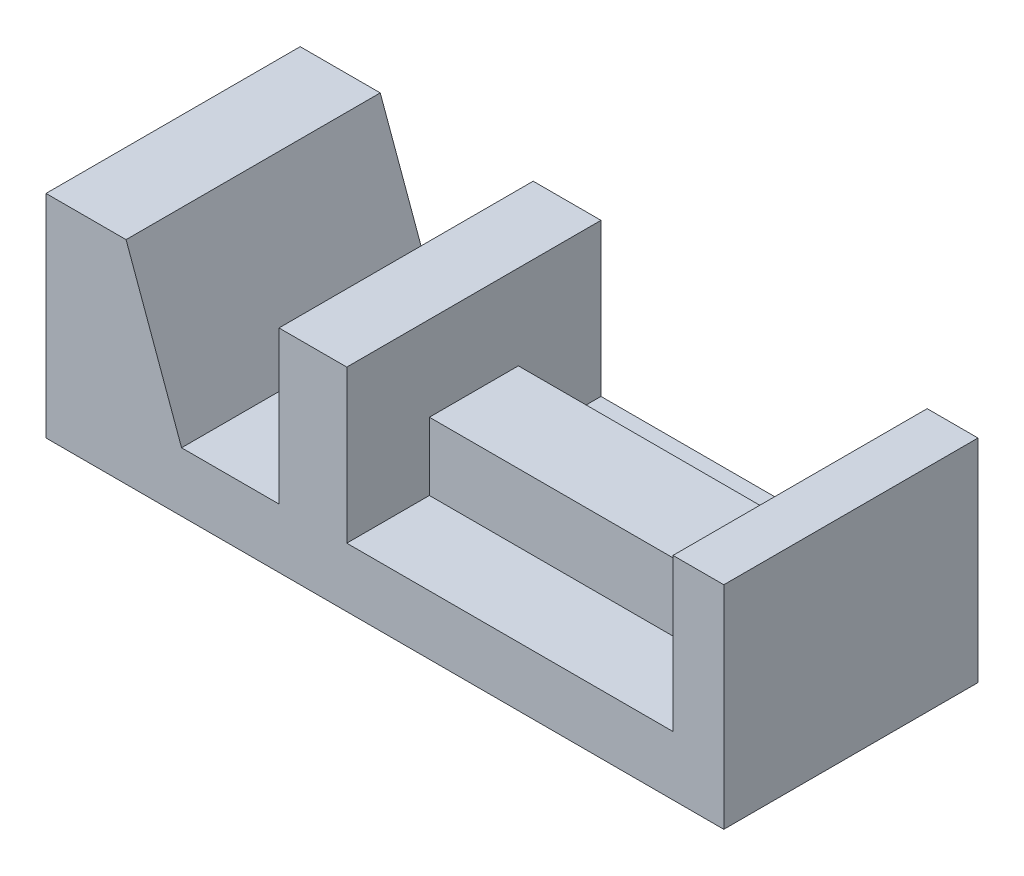
ISO-10303-21;
HEADER;
FILE_DESCRIPTION(('STEP AP214'),'2;1');
FILE_NAME('part.step','',(''),(''),'','','');
FILE_SCHEMA(('AUTOMOTIVE_DESIGN { 1 0 10303 214 1 1 1 1 }'));
ENDSEC;
DATA;
#1=APPLICATION_CONTEXT('core data for automotive mechanical design processes');
#2=APPLICATION_PROTOCOL_DEFINITION('international standard','automotive_design',2000,#1);
#3=PRODUCT_CONTEXT('',#1,'mechanical');
#4=PRODUCT('Part','Part','',(#3));
#5=PRODUCT_RELATED_PRODUCT_CATEGORY('part','',(#4));
#6=PRODUCT_DEFINITION_FORMATION('','',#4);
#7=PRODUCT_DEFINITION_CONTEXT('part definition',#1,'design');
#8=PRODUCT_DEFINITION('design','',#6,#7);
#9=PRODUCT_DEFINITION_SHAPE('','',#8);
#10=(LENGTH_UNIT() NAMED_UNIT(*) SI_UNIT(.MILLI.,.METRE.));
#11=(NAMED_UNIT(*) PLANE_ANGLE_UNIT() SI_UNIT($,.RADIAN.));
#12=(NAMED_UNIT(*) SI_UNIT($,.STERADIAN.) SOLID_ANGLE_UNIT());
#13=UNCERTAINTY_MEASURE_WITH_UNIT(LENGTH_MEASURE(1.E-05),#10,'distance_accuracy_value','');
#14=(GEOMETRIC_REPRESENTATION_CONTEXT(3) GLOBAL_UNCERTAINTY_ASSIGNED_CONTEXT((#13)) GLOBAL_UNIT_ASSIGNED_CONTEXT((#10,
#11,#12)) REPRESENTATION_CONTEXT('',''));
#15=CARTESIAN_POINT('',(0.,0.,0.));
#16=DIRECTION('',(0.,0.,1.));
#17=DIRECTION('',(1.,0.,0.));
#18=AXIS2_PLACEMENT_3D('',#15,#16,#17);
#19=CARTESIAN_POINT('',(148.,50.,60.));
#20=DIRECTION('',(1.,0.,0.));
#21=DIRECTION('',(0.,0.,-1.));
#22=AXIS2_PLACEMENT_3D('',#19,#20,#21);
#23=PLANE('',#22);
#24=DIRECTION('',(0.,-1.,0.));
#25=VECTOR('',#24,1.);
#26=CARTESIAN_POINT('',(148.,30.,40.5));
#27=LINE('',#26,#25);
#28=CARTESIAN_POINT('',(148.,30.,40.5));
#29=VERTEX_POINT('',#28);
#30=CARTESIAN_POINT('',(148.,14.,40.5));
#31=VERTEX_POINT('',#30);
#32=EDGE_CURVE('E157',#29,#31,#27,.T.);
#33=ORIENTED_EDGE('',*,*,#32,.T.);
#34=DIRECTION('',(0.,0.,-1.));
#35=VECTOR('',#34,1.);
#36=CARTESIAN_POINT('',(148.,14.,60.));
#37=LINE('',#36,#35);
#38=CARTESIAN_POINT('',(148.,14.,60.));
#39=VERTEX_POINT('',#38);
#40=EDGE_CURVE('E256',#39,#31,#37,.T.);
#41=ORIENTED_EDGE('',*,*,#40,.F.);
#42=DIRECTION('',(0.,-1.,0.));
#43=VECTOR('',#42,1.);
#44=CARTESIAN_POINT('',(148.,50.,60.));
#45=LINE('',#44,#43);
#46=CARTESIAN_POINT('',(148.,50.,60.));
#47=VERTEX_POINT('',#46);
#48=EDGE_CURVE('E189',#47,#39,#45,.T.);
#49=ORIENTED_EDGE('',*,*,#48,.F.);
#50=DIRECTION('',(0.,0.,-1.));
#51=VECTOR('',#50,1.);
#52=CARTESIAN_POINT('',(148.,50.,60.));
#53=LINE('',#52,#51);
#54=CARTESIAN_POINT('',(148.,50.,0.));
#55=VERTEX_POINT('',#54);
#56=EDGE_CURVE('E259',#47,#55,#53,.T.);
#57=ORIENTED_EDGE('',*,*,#56,.T.);
#58=DIRECTION('',(0.,-1.,0.));
#59=VECTOR('',#58,1.);
#60=CARTESIAN_POINT('',(148.,50.,0.));
#61=LINE('',#60,#59);
#62=CARTESIAN_POINT('',(148.,14.,0.));
#63=VERTEX_POINT('',#62);
#64=EDGE_CURVE('E214',#55,#63,#61,.T.);
#65=ORIENTED_EDGE('',*,*,#64,.T.);
#66=CARTESIAN_POINT('',(148.,14.,19.5));
#67=VERTEX_POINT('',#66);
#68=EDGE_CURVE('E255',#67,#63,#37,.T.);
#69=ORIENTED_EDGE('',*,*,#68,.F.);
#70=DIRECTION('',(0.,-1.,0.));
#71=VECTOR('',#70,1.);
#72=CARTESIAN_POINT('',(148.,30.,19.5));
#73=LINE('',#72,#71);
#74=CARTESIAN_POINT('',(148.,30.,19.5));
#75=VERTEX_POINT('',#74);
#76=EDGE_CURVE('E48',#75,#67,#73,.T.);
#77=ORIENTED_EDGE('',*,*,#76,.F.);
#78=DIRECTION('',(0.,0.,-1.));
#79=VECTOR('',#78,1.);
#80=CARTESIAN_POINT('',(148.,30.,40.5));
#81=LINE('',#80,#79);
#82=EDGE_CURVE('E52',#29,#75,#81,.T.);
#83=ORIENTED_EDGE('',*,*,#82,.F.);
#84=EDGE_LOOP('',(#33,#41,#49,#57,#65,#69,#77,#83));
#85=FACE_BOUND('',#84,.T.);
#86=ADVANCED_FACE('F33',(#85),#23,.F.);
#87=CARTESIAN_POINT('',(148.,14.,60.));
#88=DIRECTION('',(0.,-1.,0.));
#89=DIRECTION('',(1.,0.,0.));
#90=AXIS2_PLACEMENT_3D('',#87,#88,#89);
#91=PLANE('',#90);
#92=DIRECTION('',(1.,0.,0.));
#93=VECTOR('',#92,1.);
#94=CARTESIAN_POINT('',(71.,14.,40.5));
#95=LINE('',#94,#93);
#96=CARTESIAN_POINT('',(71.,14.,40.5));
#97=VERTEX_POINT('',#96);
#98=EDGE_CURVE('E171',#97,#31,#95,.T.);
#99=ORIENTED_EDGE('',*,*,#98,.F.);
#100=DIRECTION('',(0.,0.,-1.));
#101=VECTOR('',#100,1.);
#102=CARTESIAN_POINT('',(71.,14.,60.));
#103=LINE('',#102,#101);
#104=CARTESIAN_POINT('',(71.,14.,60.));
#105=VERTEX_POINT('',#104);
#106=EDGE_CURVE('E153',#105,#97,#103,.T.);
#107=ORIENTED_EDGE('',*,*,#106,.F.);
#108=DIRECTION('',(-1.,0.,0.));
#109=VECTOR('',#108,1.);
#110=CARTESIAN_POINT('',(148.,14.,60.));
#111=LINE('',#110,#109);
#112=EDGE_CURVE('E191',#39,#105,#111,.T.);
#113=ORIENTED_EDGE('',*,*,#112,.F.);
#114=ORIENTED_EDGE('',*,*,#40,.T.);
#115=EDGE_LOOP('',(#99,#107,#113,#114));
#116=FACE_BOUND('',#115,.T.);
#117=ADVANCED_FACE('F329',(#116),#91,.F.);
#118=DIRECTION('',(-1.,0.,0.));
#119=VECTOR('',#118,1.);
#120=CARTESIAN_POINT('',(71.,14.,19.5));
#121=LINE('',#120,#119);
#122=CARTESIAN_POINT('',(71.,14.,19.5));
#123=VERTEX_POINT('',#122);
#124=EDGE_CURVE('E168',#67,#123,#121,.T.);
#125=ORIENTED_EDGE('',*,*,#124,.F.);
#126=ORIENTED_EDGE('',*,*,#68,.T.);
#127=DIRECTION('',(-1.,0.,0.));
#128=VECTOR('',#127,1.);
#129=CARTESIAN_POINT('',(148.,14.,0.));
#130=LINE('',#129,#128);
#131=CARTESIAN_POINT('',(71.,14.,0.));
#132=VERTEX_POINT('',#131);
#133=EDGE_CURVE('E217',#63,#132,#130,.T.);
#134=ORIENTED_EDGE('',*,*,#133,.T.);
#135=EDGE_CURVE('E253',#123,#132,#103,.T.);
#136=ORIENTED_EDGE('',*,*,#135,.F.);
#137=EDGE_LOOP('',(#125,#126,#134,#136));
#138=FACE_BOUND('',#137,.T.);
#139=ADVANCED_FACE('F317',(#138),#91,.F.);
#140=CARTESIAN_POINT('',(71.,14.,60.));
#141=DIRECTION('',(-1.,0.,0.));
#142=DIRECTION('',(0.,0.,1.));
#143=AXIS2_PLACEMENT_3D('',#140,#141,#142);
#144=PLANE('',#143);
#145=DIRECTION('',(0.,-1.,0.));
#146=VECTOR('',#145,1.);
#147=CARTESIAN_POINT('',(71.,30.,40.5));
#148=LINE('',#147,#146);
#149=CARTESIAN_POINT('',(71.,30.,40.5));
#150=VERTEX_POINT('',#149);
#151=EDGE_CURVE('E145',#150,#97,#148,.T.);
#152=ORIENTED_EDGE('',*,*,#151,.F.);
#153=DIRECTION('',(0.,0.,1.));
#154=VECTOR('',#153,1.);
#155=CARTESIAN_POINT('',(71.,30.,40.5));
#156=LINE('',#155,#154);
#157=CARTESIAN_POINT('',(71.,30.,19.5));
#158=VERTEX_POINT('',#157);
#159=EDGE_CURVE('E149',#158,#150,#156,.T.);
#160=ORIENTED_EDGE('',*,*,#159,.F.);
#161=DIRECTION('',(0.,-1.,0.));
#162=VECTOR('',#161,1.);
#163=CARTESIAN_POINT('',(71.,30.,19.5));
#164=LINE('',#163,#162);
#165=EDGE_CURVE('E176',#158,#123,#164,.T.);
#166=ORIENTED_EDGE('',*,*,#165,.T.);
#167=ORIENTED_EDGE('',*,*,#135,.T.);
#168=DIRECTION('',(0.,1.,0.));
#169=VECTOR('',#168,1.);
#170=CARTESIAN_POINT('',(71.,14.,0.));
#171=LINE('',#170,#169);
#172=CARTESIAN_POINT('',(71.,50.,0.));
#173=VERTEX_POINT('',#172);
#174=EDGE_CURVE('E220',#132,#173,#171,.T.);
#175=ORIENTED_EDGE('',*,*,#174,.T.);
#176=DIRECTION('',(0.,0.,-1.));
#177=VECTOR('',#176,1.);
#178=CARTESIAN_POINT('',(71.,50.,60.));
#179=LINE('',#178,#177);
#180=CARTESIAN_POINT('',(71.,50.,60.));
#181=VERTEX_POINT('',#180);
#182=EDGE_CURVE('E250',#181,#173,#179,.T.);
#183=ORIENTED_EDGE('',*,*,#182,.F.);
#184=DIRECTION('',(0.,1.,0.));
#185=VECTOR('',#184,1.);
#186=CARTESIAN_POINT('',(71.,14.,60.));
#187=LINE('',#186,#185);
#188=EDGE_CURVE('E193',#105,#181,#187,.T.);
#189=ORIENTED_EDGE('',*,*,#188,.F.);
#190=ORIENTED_EDGE('',*,*,#106,.T.);
#191=EDGE_LOOP('',(#152,#160,#166,#167,#175,#183,#189,#190));
#192=FACE_BOUND('',#191,.T.);
#193=ADVANCED_FACE('F147',(#192),#144,.F.);
#194=CARTESIAN_POINT('',(0.,0.,60.));
#195=DIRECTION('',(0.,1.,0.));
#196=DIRECTION('',(0.,0.,1.));
#197=AXIS2_PLACEMENT_3D('',#194,#195,#196);
#198=PLANE('',#197);
#199=DIRECTION('',(1.,0.,0.));
#200=VECTOR('',#199,1.);
#201=CARTESIAN_POINT('',(0.,0.,0.));
#202=LINE('',#201,#200);
#203=CARTESIAN_POINT('',(0.,0.,0.));
#204=VERTEX_POINT('',#203);
#205=CARTESIAN_POINT('',(160.,0.,0.));
#206=VERTEX_POINT('',#205);
#207=EDGE_CURVE('E156',#204,#206,#202,.T.);
#208=ORIENTED_EDGE('',*,*,#207,.T.);
#209=DIRECTION('',(0.,0.,-1.));
#210=VECTOR('',#209,1.);
#211=CARTESIAN_POINT('',(160.,0.,60.));
#212=LINE('',#211,#210);
#213=CARTESIAN_POINT('',(160.,0.,60.));
#214=VERTEX_POINT('',#213);
#215=EDGE_CURVE('E11',#214,#206,#212,.T.);
#216=ORIENTED_EDGE('',*,*,#215,.F.);
#217=DIRECTION('',(1.,0.,0.));
#218=VECTOR('',#217,1.);
#219=CARTESIAN_POINT('',(0.,0.,60.));
#220=LINE('',#219,#218);
#221=CARTESIAN_POINT('',(0.,0.,60.));
#222=VERTEX_POINT('',#221);
#223=EDGE_CURVE('E181',#222,#214,#220,.T.);
#224=ORIENTED_EDGE('',*,*,#223,.F.);
#225=DIRECTION('',(0.,0.,-1.));
#226=VECTOR('',#225,1.);
#227=CARTESIAN_POINT('',(0.,0.,60.));
#228=LINE('',#227,#226);
#229=EDGE_CURVE('E207',#222,#204,#228,.T.);
#230=ORIENTED_EDGE('',*,*,#229,.T.);
#231=EDGE_LOOP('',(#208,#216,#224,#230));
#232=FACE_BOUND('',#231,.T.);
#233=ADVANCED_FACE('F35',(#232),#198,.F.);
#234=CARTESIAN_POINT('',(160.,0.,60.));
#235=DIRECTION('',(-1.,0.,0.));
#236=DIRECTION('',(0.,0.,1.));
#237=AXIS2_PLACEMENT_3D('',#234,#235,#236);
#238=PLANE('',#237);
#239=DIRECTION('',(0.,1.,0.));
#240=VECTOR('',#239,1.);
#241=CARTESIAN_POINT('',(160.,0.,0.));
#242=LINE('',#241,#240);
#243=CARTESIAN_POINT('',(160.,50.,0.));
#244=VERTEX_POINT('',#243);
#245=EDGE_CURVE('E210',#206,#244,#242,.T.);
#246=ORIENTED_EDGE('',*,*,#245,.T.);
#247=DIRECTION('',(0.,0.,-1.));
#248=VECTOR('',#247,1.);
#249=CARTESIAN_POINT('',(160.,50.,60.));
#250=LINE('',#249,#248);
#251=CARTESIAN_POINT('',(160.,50.,60.));
#252=VERTEX_POINT('',#251);
#253=EDGE_CURVE('E41',#252,#244,#250,.T.);
#254=ORIENTED_EDGE('',*,*,#253,.F.);
#255=DIRECTION('',(0.,1.,0.));
#256=VECTOR('',#255,1.);
#257=CARTESIAN_POINT('',(160.,0.,60.));
#258=LINE('',#257,#256);
#259=EDGE_CURVE('E184',#214,#252,#258,.T.);
#260=ORIENTED_EDGE('',*,*,#259,.F.);
#261=ORIENTED_EDGE('',*,*,#215,.T.);
#262=EDGE_LOOP('',(#246,#254,#260,#261));
#263=FACE_BOUND('',#262,.T.);
#264=ADVANCED_FACE('F282',(#263),#238,.F.);
#265=CARTESIAN_POINT('',(160.,50.,60.));
#266=DIRECTION('',(0.,-1.,0.));
#267=DIRECTION('',(0.,0.,-1.));
#268=AXIS2_PLACEMENT_3D('',#265,#266,#267);
#269=PLANE('',#268);
#270=DIRECTION('',(-1.,0.,0.));
#271=VECTOR('',#270,1.);
#272=CARTESIAN_POINT('',(160.,50.,0.));
#273=LINE('',#272,#271);
#274=EDGE_CURVE('E212',#244,#55,#273,.T.);
#275=ORIENTED_EDGE('',*,*,#274,.T.);
#276=ORIENTED_EDGE('',*,*,#56,.F.);
#277=DIRECTION('',(-1.,0.,0.));
#278=VECTOR('',#277,1.);
#279=CARTESIAN_POINT('',(160.,50.,60.));
#280=LINE('',#279,#278);
#281=EDGE_CURVE('E187',#252,#47,#280,.T.);
#282=ORIENTED_EDGE('',*,*,#281,.F.);
#283=ORIENTED_EDGE('',*,*,#253,.T.);
#284=EDGE_LOOP('',(#275,#276,#282,#283));
#285=FACE_BOUND('',#284,.T.);
#286=ADVANCED_FACE('F266',(#285),#269,.F.);
#287=CARTESIAN_POINT('',(71.,50.,60.));
#288=DIRECTION('',(0.,-1.,0.));
#289=DIRECTION('',(0.,0.,-1.));
#290=AXIS2_PLACEMENT_3D('',#287,#288,#289);
#291=PLANE('',#290);
#292=DIRECTION('',(-1.,0.,0.));
#293=VECTOR('',#292,1.);
#294=CARTESIAN_POINT('',(71.,50.,0.));
#295=LINE('',#294,#293);
#296=CARTESIAN_POINT('',(55.,50.,0.));
#297=VERTEX_POINT('',#296);
#298=EDGE_CURVE('E222',#173,#297,#295,.T.);
#299=ORIENTED_EDGE('',*,*,#298,.T.);
#300=DIRECTION('',(0.,0.,-1.));
#301=VECTOR('',#300,1.);
#302=CARTESIAN_POINT('',(55.,50.,60.));
#303=LINE('',#302,#301);
#304=CARTESIAN_POINT('',(55.,50.,60.));
#305=VERTEX_POINT('',#304);
#306=EDGE_CURVE('E247',#305,#297,#303,.T.);
#307=ORIENTED_EDGE('',*,*,#306,.F.);
#308=DIRECTION('',(-1.,0.,0.));
#309=VECTOR('',#308,1.);
#310=CARTESIAN_POINT('',(71.,50.,60.));
#311=LINE('',#310,#309);
#312=EDGE_CURVE('E195',#181,#305,#311,.T.);
#313=ORIENTED_EDGE('',*,*,#312,.F.);
#314=ORIENTED_EDGE('',*,*,#182,.T.);
#315=EDGE_LOOP('',(#299,#307,#313,#314));
#316=FACE_BOUND('',#315,.T.);
#317=ADVANCED_FACE('F313',(#316),#291,.F.);
#318=CARTESIAN_POINT('',(55.,50.,60.));
#319=DIRECTION('',(1.,0.,0.));
#320=DIRECTION('',(0.,0.,-1.));
#321=AXIS2_PLACEMENT_3D('',#318,#319,#320);
#322=PLANE('',#321);
#323=DIRECTION('',(0.,-1.,0.));
#324=VECTOR('',#323,1.);
#325=CARTESIAN_POINT('',(55.,50.,0.));
#326=LINE('',#325,#324);
#327=CARTESIAN_POINT('',(55.,14.,0.));
#328=VERTEX_POINT('',#327);
#329=EDGE_CURVE('E224',#297,#328,#326,.T.);
#330=ORIENTED_EDGE('',*,*,#329,.T.);
#331=DIRECTION('',(0.,0.,-1.));
#332=VECTOR('',#331,1.);
#333=CARTESIAN_POINT('',(55.,14.,60.));
#334=LINE('',#333,#332);
#335=CARTESIAN_POINT('',(55.,14.,60.));
#336=VERTEX_POINT('',#335);
#337=EDGE_CURVE('E244',#336,#328,#334,.T.);
#338=ORIENTED_EDGE('',*,*,#337,.F.);
#339=DIRECTION('',(0.,-1.,0.));
#340=VECTOR('',#339,1.);
#341=CARTESIAN_POINT('',(55.,50.,60.));
#342=LINE('',#341,#340);
#343=EDGE_CURVE('E197',#305,#336,#342,.T.);
#344=ORIENTED_EDGE('',*,*,#343,.F.);
#345=ORIENTED_EDGE('',*,*,#306,.T.);
#346=EDGE_LOOP('',(#330,#338,#344,#345));
#347=FACE_BOUND('',#346,.T.);
#348=ADVANCED_FACE('F309',(#347),#322,.F.);
#349=CARTESIAN_POINT('',(55.,14.,60.));
#350=DIRECTION('',(0.,-1.,0.));
#351=DIRECTION('',(1.,0.,0.));
#352=AXIS2_PLACEMENT_3D('',#349,#350,#351);
#353=PLANE('',#352);
#354=DIRECTION('',(-1.,0.,0.));
#355=VECTOR('',#354,1.);
#356=CARTESIAN_POINT('',(55.,14.,0.));
#357=LINE('',#356,#355);
#358=CARTESIAN_POINT('',(32.,14.,0.));
#359=VERTEX_POINT('',#358);
#360=EDGE_CURVE('E226',#328,#359,#357,.T.);
#361=ORIENTED_EDGE('',*,*,#360,.T.);
#362=DIRECTION('',(0.,0.,-1.));
#363=VECTOR('',#362,1.);
#364=CARTESIAN_POINT('',(32.,14.,60.));
#365=LINE('',#364,#363);
#366=CARTESIAN_POINT('',(32.,14.,60.));
#367=VERTEX_POINT('',#366);
#368=EDGE_CURVE('E241',#367,#359,#365,.T.);
#369=ORIENTED_EDGE('',*,*,#368,.F.);
#370=DIRECTION('',(-1.,0.,0.));
#371=VECTOR('',#370,1.);
#372=CARTESIAN_POINT('',(55.,14.,60.));
#373=LINE('',#372,#371);
#374=EDGE_CURVE('E199',#336,#367,#373,.T.);
#375=ORIENTED_EDGE('',*,*,#374,.F.);
#376=ORIENTED_EDGE('',*,*,#337,.T.);
#377=EDGE_LOOP('',(#361,#369,#375,#376));
#378=FACE_BOUND('',#377,.T.);
#379=ADVANCED_FACE('F304',(#378),#353,.F.);
#380=CARTESIAN_POINT('',(32.,14.,60.));
#381=DIRECTION('',(-0.939692620785907,-0.342020143325673,0.));
#382=DIRECTION('',(0.342020143325673,-0.939692620785907,0.));
#383=AXIS2_PLACEMENT_3D('',#380,#381,#382);
#384=PLANE('',#383);
#385=DIRECTION('',(-0.342020143325673,0.939692620785907,0.));
#386=VECTOR('',#385,1.);
#387=CARTESIAN_POINT('',(32.,14.,0.));
#388=LINE('',#387,#386);
#389=CARTESIAN_POINT('',(18.8970715664165,50.,0.));
#390=VERTEX_POINT('',#389);
#391=EDGE_CURVE('E228',#359,#390,#388,.T.);
#392=ORIENTED_EDGE('',*,*,#391,.T.);
#393=DIRECTION('',(0.,0.,-1.));
#394=VECTOR('',#393,1.);
#395=CARTESIAN_POINT('',(18.8970715664165,50.,60.));
#396=LINE('',#395,#394);
#397=CARTESIAN_POINT('',(18.8970715664165,50.,60.));
#398=VERTEX_POINT('',#397);
#399=EDGE_CURVE('E238',#398,#390,#396,.T.);
#400=ORIENTED_EDGE('',*,*,#399,.F.);
#401=DIRECTION('',(-0.342020143325673,0.939692620785907,0.));
#402=VECTOR('',#401,1.);
#403=CARTESIAN_POINT('',(32.,14.,60.));
#404=LINE('',#403,#402);
#405=EDGE_CURVE('E201',#367,#398,#404,.T.);
#406=ORIENTED_EDGE('',*,*,#405,.F.);
#407=ORIENTED_EDGE('',*,*,#368,.T.);
#408=EDGE_LOOP('',(#392,#400,#406,#407));
#409=FACE_BOUND('',#408,.T.);
#410=ADVANCED_FACE('F298',(#409),#384,.F.);
#411=CARTESIAN_POINT('',(0.,50.,60.));
#412=DIRECTION('',(0.,-1.,0.));
#413=DIRECTION('',(0.,0.,-1.));
#414=AXIS2_PLACEMENT_3D('',#411,#412,#413);
#415=PLANE('',#414);
#416=DIRECTION('',(-1.,0.,0.));
#417=VECTOR('',#416,1.);
#418=CARTESIAN_POINT('',(0.,50.,0.));
#419=LINE('',#418,#417);
#420=CARTESIAN_POINT('',(0.,50.,0.));
#421=VERTEX_POINT('',#420);
#422=EDGE_CURVE('E230',#390,#421,#419,.T.);
#423=ORIENTED_EDGE('',*,*,#422,.T.);
#424=DIRECTION('',(0.,0.,-1.));
#425=VECTOR('',#424,1.);
#426=CARTESIAN_POINT('',(0.,50.,60.));
#427=LINE('',#426,#425);
#428=CARTESIAN_POINT('',(0.,50.,60.));
#429=VERTEX_POINT('',#428);
#430=EDGE_CURVE('E235',#429,#421,#427,.T.);
#431=ORIENTED_EDGE('',*,*,#430,.F.);
#432=DIRECTION('',(-1.,0.,0.));
#433=VECTOR('',#432,1.);
#434=CARTESIAN_POINT('',(0.,50.,60.));
#435=LINE('',#434,#433);
#436=EDGE_CURVE('E203',#398,#429,#435,.T.);
#437=ORIENTED_EDGE('',*,*,#436,.F.);
#438=ORIENTED_EDGE('',*,*,#399,.T.);
#439=EDGE_LOOP('',(#423,#431,#437,#438));
#440=FACE_BOUND('',#439,.T.);
#441=ADVANCED_FACE('F294',(#440),#415,.F.);
#442=CARTESIAN_POINT('',(0.,0.,60.));
#443=DIRECTION('',(1.,0.,0.));
#444=DIRECTION('',(0.,0.,-1.));
#445=AXIS2_PLACEMENT_3D('',#442,#443,#444);
#446=PLANE('',#445);
#447=DIRECTION('',(0.,-1.,0.));
#448=VECTOR('',#447,1.);
#449=CARTESIAN_POINT('',(0.,0.,0.));
#450=LINE('',#449,#448);
#451=EDGE_CURVE('E185',#421,#204,#450,.T.);
#452=ORIENTED_EDGE('',*,*,#451,.T.);
#453=ORIENTED_EDGE('',*,*,#229,.F.);
#454=DIRECTION('',(0.,-1.,0.));
#455=VECTOR('',#454,1.);
#456=CARTESIAN_POINT('',(0.,0.,60.));
#457=LINE('',#456,#455);
#458=EDGE_CURVE('E205',#429,#222,#457,.T.);
#459=ORIENTED_EDGE('',*,*,#458,.F.);
#460=ORIENTED_EDGE('',*,*,#430,.T.);
#461=EDGE_LOOP('',(#452,#453,#459,#460));
#462=FACE_BOUND('',#461,.T.);
#463=ADVANCED_FACE('F289',(#462),#446,.F.);
#464=CARTESIAN_POINT('',(0.,0.,60.));
#465=DIRECTION('',(0.,0.,1.));
#466=DIRECTION('',(1.,0.,0.));
#467=AXIS2_PLACEMENT_3D('',#464,#465,#466);
#468=PLANE('',#467);
#469=ORIENTED_EDGE('',*,*,#223,.T.);
#470=ORIENTED_EDGE('',*,*,#259,.T.);
#471=ORIENTED_EDGE('',*,*,#281,.T.);
#472=ORIENTED_EDGE('',*,*,#48,.T.);
#473=ORIENTED_EDGE('',*,*,#112,.T.);
#474=ORIENTED_EDGE('',*,*,#188,.T.);
#475=ORIENTED_EDGE('',*,*,#312,.T.);
#476=ORIENTED_EDGE('',*,*,#343,.T.);
#477=ORIENTED_EDGE('',*,*,#374,.T.);
#478=ORIENTED_EDGE('',*,*,#405,.T.);
#479=ORIENTED_EDGE('',*,*,#436,.T.);
#480=ORIENTED_EDGE('',*,*,#458,.T.);
#481=EDGE_LOOP('',(#469,#470,#471,#472,#473,#474,#475,#476,#477,#478,#479,#480));
#482=FACE_BOUND('',#481,.T.);
#483=ADVANCED_FACE('F279',(#482),#468,.T.);
#484=CARTESIAN_POINT('',(0.,0.,0.));
#485=DIRECTION('',(0.,0.,1.));
#486=DIRECTION('',(1.,0.,0.));
#487=AXIS2_PLACEMENT_3D('',#484,#485,#486);
#488=PLANE('',#487);
#489=ORIENTED_EDGE('',*,*,#207,.F.);
#490=ORIENTED_EDGE('',*,*,#451,.F.);
#491=ORIENTED_EDGE('',*,*,#422,.F.);
#492=ORIENTED_EDGE('',*,*,#391,.F.);
#493=ORIENTED_EDGE('',*,*,#360,.F.);
#494=ORIENTED_EDGE('',*,*,#329,.F.);
#495=ORIENTED_EDGE('',*,*,#298,.F.);
#496=ORIENTED_EDGE('',*,*,#174,.F.);
#497=ORIENTED_EDGE('',*,*,#133,.F.);
#498=ORIENTED_EDGE('',*,*,#64,.F.);
#499=ORIENTED_EDGE('',*,*,#274,.F.);
#500=ORIENTED_EDGE('',*,*,#245,.F.);
#501=EDGE_LOOP('',(#489,#490,#491,#492,#493,#494,#495,#496,#497,#498,#499,#500));
#502=FACE_BOUND('',#501,.T.);
#503=ADVANCED_FACE('F272',(#502),#488,.F.);
#504=CARTESIAN_POINT('',(71.,30.,40.5));
#505=DIRECTION('',(0.,0.,-1.));
#506=DIRECTION('',(-1.,0.,0.));
#507=AXIS2_PLACEMENT_3D('',#504,#505,#506);
#508=PLANE('',#507);
#509=ORIENTED_EDGE('',*,*,#98,.T.);
#510=ORIENTED_EDGE('',*,*,#32,.F.);
#511=DIRECTION('',(1.,0.,0.));
#512=VECTOR('',#511,1.);
#513=CARTESIAN_POINT('',(71.,30.,40.5));
#514=LINE('',#513,#512);
#515=EDGE_CURVE('E160',#150,#29,#514,.T.);
#516=ORIENTED_EDGE('',*,*,#515,.F.);
#517=ORIENTED_EDGE('',*,*,#151,.T.);
#518=EDGE_LOOP('',(#509,#510,#516,#517));
#519=FACE_BOUND('',#518,.T.);
#520=ADVANCED_FACE('F161',(#519),#508,.F.);
#521=CARTESIAN_POINT('',(71.,30.,19.5));
#522=DIRECTION('',(0.,0.,1.));
#523=DIRECTION('',(1.,0.,0.));
#524=AXIS2_PLACEMENT_3D('',#521,#522,#523);
#525=PLANE('',#524);
#526=ORIENTED_EDGE('',*,*,#124,.T.);
#527=ORIENTED_EDGE('',*,*,#165,.F.);
#528=DIRECTION('',(-1.,0.,0.));
#529=VECTOR('',#528,1.);
#530=CARTESIAN_POINT('',(71.,30.,19.5));
#531=LINE('',#530,#529);
#532=EDGE_CURVE('E166',#75,#158,#531,.T.);
#533=ORIENTED_EDGE('',*,*,#532,.F.);
#534=ORIENTED_EDGE('',*,*,#76,.T.);
#535=EDGE_LOOP('',(#526,#527,#533,#534));
#536=FACE_BOUND('',#535,.T.);
#537=ADVANCED_FACE('F319',(#536),#525,.F.);
#538=CARTESIAN_POINT('',(0.,30.,0.));
#539=DIRECTION('',(0.,-1.,0.));
#540=DIRECTION('',(1.,0.,0.));
#541=AXIS2_PLACEMENT_3D('',#538,#539,#540);
#542=PLANE('',#541);
#543=ORIENTED_EDGE('',*,*,#159,.T.);
#544=ORIENTED_EDGE('',*,*,#515,.T.);
#545=ORIENTED_EDGE('',*,*,#82,.T.);
#546=ORIENTED_EDGE('',*,*,#532,.T.);
#547=EDGE_LOOP('',(#543,#544,#545,#546));
#548=FACE_BOUND('',#547,.T.);
#549=ADVANCED_FACE('F164',(#548),#542,.F.);
#550=CLOSED_SHELL('',(#86,#117,#139,#193,#233,#264,#286,#317,#348,#379,#410,#441,#463,#483,#503,
#520,#537,#549));
#551=MANIFOLD_SOLID_BREP('B2',#550);
#552=ADVANCED_BREP_SHAPE_REPRESENTATION('',(#18,#551),#14);
#553=SHAPE_DEFINITION_REPRESENTATION(#9,#552);
ENDSEC;
END-ISO-10303-21;
